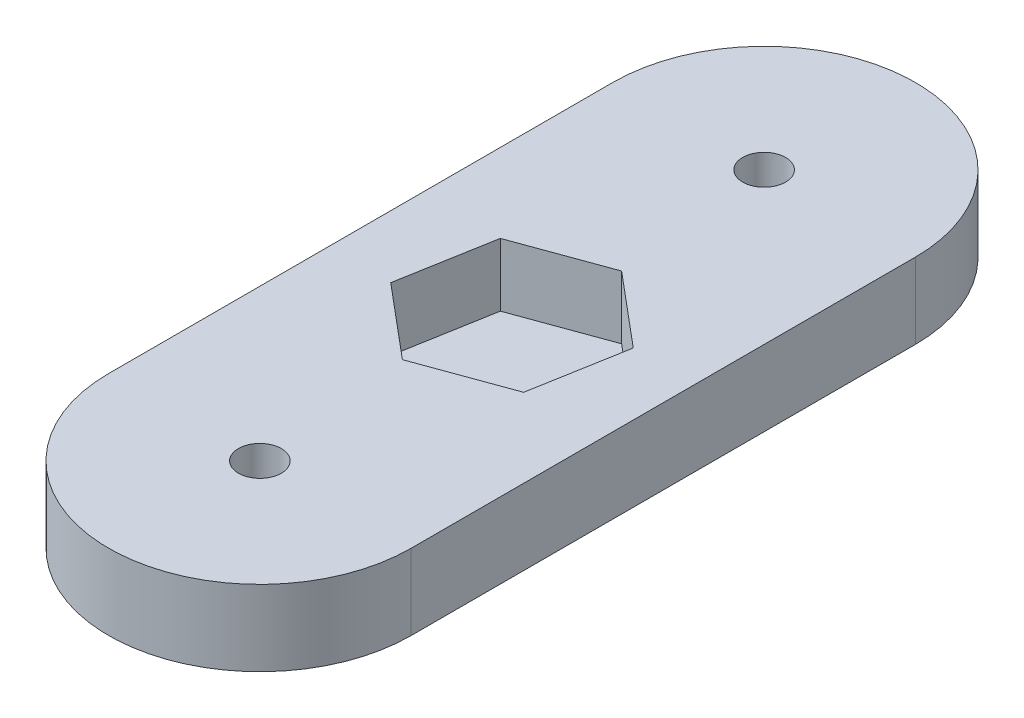
ISO-10303-21;
HEADER;
FILE_DESCRIPTION(('STEP AP214'),'2;1');
FILE_NAME('part.step','',(''),(''),'','','');
FILE_SCHEMA(('AUTOMOTIVE_DESIGN { 1 0 10303 214 1 1 1 1 }'));
ENDSEC;
DATA;
#1=APPLICATION_CONTEXT('core data for automotive mechanical design processes');
#2=APPLICATION_PROTOCOL_DEFINITION('international standard','automotive_design',2000,#1);
#3=PRODUCT_CONTEXT('',#1,'mechanical');
#4=PRODUCT('Part','Part','',(#3));
#5=PRODUCT_RELATED_PRODUCT_CATEGORY('part','',(#4));
#6=PRODUCT_DEFINITION_FORMATION('','',#4);
#7=PRODUCT_DEFINITION_CONTEXT('part definition',#1,'design');
#8=PRODUCT_DEFINITION('design','',#6,#7);
#9=PRODUCT_DEFINITION_SHAPE('','',#8);
#10=(LENGTH_UNIT() NAMED_UNIT(*) SI_UNIT(.MILLI.,.METRE.));
#11=(NAMED_UNIT(*) PLANE_ANGLE_UNIT() SI_UNIT($,.RADIAN.));
#12=(NAMED_UNIT(*) SI_UNIT($,.STERADIAN.) SOLID_ANGLE_UNIT());
#13=UNCERTAINTY_MEASURE_WITH_UNIT(LENGTH_MEASURE(1.E-05),#10,'distance_accuracy_value','');
#14=(GEOMETRIC_REPRESENTATION_CONTEXT(3) GLOBAL_UNCERTAINTY_ASSIGNED_CONTEXT((#13)) GLOBAL_UNIT_ASSIGNED_CONTEXT((#10,
#11,#12)) REPRESENTATION_CONTEXT('',''));
#15=CARTESIAN_POINT('',(0.,0.,0.));
#16=DIRECTION('',(0.,0.,1.));
#17=DIRECTION('',(1.,0.,0.));
#18=AXIS2_PLACEMENT_3D('',#15,#16,#17);
#19=CARTESIAN_POINT('',(0.,6.,0.));
#20=DIRECTION('',(0.,1.,0.));
#21=DIRECTION('',(0.,0.,1.));
#22=AXIS2_PLACEMENT_3D('',#19,#20,#21);
#23=PLANE('',#22);
#24=DIRECTION('',(0.939692620785907,0.,-0.342020143325673));
#25=VECTOR('',#24,1.);
#26=CARTESIAN_POINT('',(-1.30332568756374,6.,-12.6084727230788));
#27=LINE('',#26,#25);
#28=CARTESIAN_POINT('',(-1.30332568756374,6.,-12.6084727230788));
#29=VERTEX_POINT('',#28);
#30=CARTESIAN_POINT('',(5.74958755079748,6.,-15.1755232067044));
#31=VERTEX_POINT('',#30);
#32=EDGE_CURVE('E48',#29,#31,#27,.T.);
#33=ORIENTED_EDGE('',*,*,#32,.F.);
#34=DIRECTION('',(0.766044443118981,0.,0.642787609686536));
#35=VECTOR('',#34,1.);
#36=CARTESIAN_POINT('',(-7.05291323836123,6.,-17.4329495163744));
#37=LINE('',#36,#35);
#38=CARTESIAN_POINT('',(-7.05291323836123,6.,-17.4329495163744));
#39=VERTEX_POINT('',#38);
#40=EDGE_CURVE('E140',#39,#29,#37,.T.);
#41=ORIENTED_EDGE('',*,*,#40,.F.);
#42=DIRECTION('',(-0.173648177666927,0.,0.984807753012209));
#43=VECTOR('',#42,1.);
#44=CARTESIAN_POINT('',(-5.74958755079748,6.,-24.8244767932956));
#45=LINE('',#44,#43);
#46=CARTESIAN_POINT('',(-5.74958755079748,6.,-24.8244767932956));
#47=VERTEX_POINT('',#46);
#48=EDGE_CURVE('E143',#47,#39,#45,.T.);
#49=ORIENTED_EDGE('',*,*,#48,.F.);
#50=DIRECTION('',(-0.939692620785907,0.,0.342020143325673));
#51=VECTOR('',#50,1.);
#52=CARTESIAN_POINT('',(1.30332568756374,6.,-27.3915272769212));
#53=LINE('',#52,#51);
#54=CARTESIAN_POINT('',(1.30332568756374,6.,-27.3915272769212));
#55=VERTEX_POINT('',#54);
#56=EDGE_CURVE('E159',#55,#47,#53,.T.);
#57=ORIENTED_EDGE('',*,*,#56,.F.);
#58=DIRECTION('',(-0.766044443118981,0.,-0.642787609686536));
#59=VECTOR('',#58,1.);
#60=CARTESIAN_POINT('',(7.05291323836123,6.,-22.5670504836256));
#61=LINE('',#60,#59);
#62=CARTESIAN_POINT('',(7.05291323836123,6.,-22.5670504836256));
#63=VERTEX_POINT('',#62);
#64=EDGE_CURVE('E156',#63,#55,#61,.T.);
#65=ORIENTED_EDGE('',*,*,#64,.F.);
#66=DIRECTION('',(0.173648177666927,0.,-0.984807753012209));
#67=VECTOR('',#66,1.);
#68=CARTESIAN_POINT('',(5.74958755079749,6.,-15.1755232067044));
#69=LINE('',#68,#67);
#70=EDGE_CURVE('E154',#31,#63,#69,.T.);
#71=ORIENTED_EDGE('',*,*,#70,.F.);
#72=EDGE_LOOP('',(#33,#41,#49,#57,#65,#71));
#73=FACE_BOUND('',#72,.T.);
#74=CARTESIAN_POINT('',(0.,6.,-40.));
#75=DIRECTION('',(0.,1.,0.));
#76=DIRECTION('',(0.,0.,1.));
#77=AXIS2_PLACEMENT_3D('',#74,#75,#76);
#78=CIRCLE('',#77,1.7);
#79=CARTESIAN_POINT('',(0.,6.,-38.3));
#80=VERTEX_POINT('',#79);
#81=EDGE_CURVE('E180',#80,#80,#78,.T.);
#82=ORIENTED_EDGE('',*,*,#81,.F.);
#83=EDGE_LOOP('',(#82));
#84=FACE_BOUND('',#83,.T.);
#85=CARTESIAN_POINT('',(0.,6.,0.));
#86=DIRECTION('',(0.,1.,0.));
#87=DIRECTION('',(0.,0.,1.));
#88=AXIS2_PLACEMENT_3D('',#85,#86,#87);
#89=CIRCLE('',#88,12.);
#90=CARTESIAN_POINT('',(-12.,6.,0.));
#91=VERTEX_POINT('',#90);
#92=CARTESIAN_POINT('',(12.,6.,0.));
#93=VERTEX_POINT('',#92);
#94=EDGE_CURVE('E186',#91,#93,#89,.T.);
#95=ORIENTED_EDGE('',*,*,#94,.T.);
#96=DIRECTION('',(0.,0.,-1.));
#97=VECTOR('',#96,1.);
#98=CARTESIAN_POINT('',(12.,6.,0.));
#99=LINE('',#98,#97);
#100=CARTESIAN_POINT('',(12.,6.,-40.));
#101=VERTEX_POINT('',#100);
#102=EDGE_CURVE('E85',#93,#101,#99,.T.);
#103=ORIENTED_EDGE('',*,*,#102,.T.);
#104=CARTESIAN_POINT('',(0.,6.,-40.));
#105=DIRECTION('',(0.,1.,0.));
#106=DIRECTION('',(0.,0.,1.));
#107=AXIS2_PLACEMENT_3D('',#104,#105,#106);
#108=CIRCLE('',#107,12.);
#109=CARTESIAN_POINT('',(-12.,6.,-40.));
#110=VERTEX_POINT('',#109);
#111=EDGE_CURVE('E189',#101,#110,#108,.T.);
#112=ORIENTED_EDGE('',*,*,#111,.T.);
#113=DIRECTION('',(0.,0.,1.));
#114=VECTOR('',#113,1.);
#115=CARTESIAN_POINT('',(-12.,6.,0.));
#116=LINE('',#115,#114);
#117=EDGE_CURVE('E57',#110,#91,#116,.T.);
#118=ORIENTED_EDGE('',*,*,#117,.T.);
#119=EDGE_LOOP('',(#95,#103,#112,#118));
#120=FACE_BOUND('',#119,.T.);
#121=CARTESIAN_POINT('',(0.,6.,0.));
#122=DIRECTION('',(0.,1.,0.));
#123=DIRECTION('',(0.,0.,1.));
#124=AXIS2_PLACEMENT_3D('',#121,#122,#123);
#125=CIRCLE('',#124,1.7);
#126=CARTESIAN_POINT('',(0.,6.,1.7));
#127=VERTEX_POINT('',#126);
#128=EDGE_CURVE('E174',#127,#127,#125,.T.);
#129=ORIENTED_EDGE('',*,*,#128,.F.);
#130=EDGE_LOOP('',(#129));
#131=FACE_BOUND('',#130,.T.);
#132=ADVANCED_FACE('F33',(#73,#84,#120,#131),#23,.T.);
#133=CARTESIAN_POINT('',(0.,0.,0.));
#134=DIRECTION('',(0.,1.,0.));
#135=DIRECTION('',(0.,0.,1.));
#136=AXIS2_PLACEMENT_3D('',#133,#134,#135);
#137=PLANE('',#136);
#138=CARTESIAN_POINT('',(0.,0.,-40.));
#139=DIRECTION('',(0.,1.,0.));
#140=DIRECTION('',(0.,0.,1.));
#141=AXIS2_PLACEMENT_3D('',#138,#139,#140);
#142=CIRCLE('',#141,1.7);
#143=CARTESIAN_POINT('',(0.,0.,-38.3));
#144=VERTEX_POINT('',#143);
#145=EDGE_CURVE('E177',#144,#144,#142,.T.);
#146=ORIENTED_EDGE('',*,*,#145,.T.);
#147=EDGE_LOOP('',(#146));
#148=FACE_BOUND('',#147,.T.);
#149=CARTESIAN_POINT('',(0.,0.,0.));
#150=DIRECTION('',(0.,1.,0.));
#151=DIRECTION('',(0.,0.,1.));
#152=AXIS2_PLACEMENT_3D('',#149,#150,#151);
#153=CIRCLE('',#152,12.);
#154=CARTESIAN_POINT('',(-12.,0.,0.));
#155=VERTEX_POINT('',#154);
#156=CARTESIAN_POINT('',(12.,0.,0.));
#157=VERTEX_POINT('',#156);
#158=EDGE_CURVE('E183',#155,#157,#153,.T.);
#159=ORIENTED_EDGE('',*,*,#158,.F.);
#160=DIRECTION('',(0.,0.,1.));
#161=VECTOR('',#160,1.);
#162=CARTESIAN_POINT('',(-12.,0.,0.));
#163=LINE('',#162,#161);
#164=CARTESIAN_POINT('',(-12.,0.,-40.));
#165=VERTEX_POINT('',#164);
#166=EDGE_CURVE('E78',#165,#155,#163,.T.);
#167=ORIENTED_EDGE('',*,*,#166,.F.);
#168=CARTESIAN_POINT('',(0.,0.,-40.));
#169=DIRECTION('',(0.,1.,0.));
#170=DIRECTION('',(0.,0.,1.));
#171=AXIS2_PLACEMENT_3D('',#168,#169,#170);
#172=CIRCLE('',#171,12.);
#173=CARTESIAN_POINT('',(12.,0.,-40.));
#174=VERTEX_POINT('',#173);
#175=EDGE_CURVE('E197',#174,#165,#172,.T.);
#176=ORIENTED_EDGE('',*,*,#175,.F.);
#177=DIRECTION('',(0.,0.,-1.));
#178=VECTOR('',#177,1.);
#179=CARTESIAN_POINT('',(12.,0.,0.));
#180=LINE('',#179,#178);
#181=EDGE_CURVE('E195',#157,#174,#180,.T.);
#182=ORIENTED_EDGE('',*,*,#181,.F.);
#183=EDGE_LOOP('',(#159,#167,#176,#182));
#184=FACE_BOUND('',#183,.T.);
#185=CARTESIAN_POINT('',(0.,0.,0.));
#186=DIRECTION('',(0.,1.,0.));
#187=DIRECTION('',(0.,0.,1.));
#188=AXIS2_PLACEMENT_3D('',#185,#186,#187);
#189=CIRCLE('',#188,1.7);
#190=CARTESIAN_POINT('',(0.,0.,1.7));
#191=VERTEX_POINT('',#190);
#192=EDGE_CURVE('E166',#191,#191,#189,.T.);
#193=ORIENTED_EDGE('',*,*,#192,.T.);
#194=EDGE_LOOP('',(#193));
#195=FACE_BOUND('',#194,.T.);
#196=ADVANCED_FACE('F210',(#148,#184,#195),#137,.F.);
#197=CARTESIAN_POINT('',(0.,6.,0.));
#198=DIRECTION('',(0.,-1.,0.));
#199=DIRECTION('',(0.,0.,-1.));
#200=AXIS2_PLACEMENT_3D('',#197,#198,#199);
#201=CYLINDRICAL_SURFACE('',#200,12.);
#202=ORIENTED_EDGE('',*,*,#158,.T.);
#203=DIRECTION('',(0.,-1.,0.));
#204=VECTOR('',#203,1.);
#205=CARTESIAN_POINT('',(12.,6.,0.));
#206=LINE('',#205,#204);
#207=EDGE_CURVE('E11',#93,#157,#206,.T.);
#208=ORIENTED_EDGE('',*,*,#207,.F.);
#209=ORIENTED_EDGE('',*,*,#94,.F.);
#210=DIRECTION('',(0.,-1.,0.));
#211=VECTOR('',#210,1.);
#212=CARTESIAN_POINT('',(-12.,6.,0.));
#213=LINE('',#212,#211);
#214=EDGE_CURVE('E192',#91,#155,#213,.T.);
#215=ORIENTED_EDGE('',*,*,#214,.T.);
#216=EDGE_LOOP('',(#202,#208,#209,#215));
#217=FACE_BOUND('',#216,.T.);
#218=ADVANCED_FACE('F35',(#217),#201,.T.);
#219=CARTESIAN_POINT('',(12.,6.,0.));
#220=DIRECTION('',(-1.,0.,0.));
#221=DIRECTION('',(0.,0.,1.));
#222=AXIS2_PLACEMENT_3D('',#219,#220,#221);
#223=PLANE('',#222);
#224=ORIENTED_EDGE('',*,*,#181,.T.);
#225=DIRECTION('',(0.,-1.,0.));
#226=VECTOR('',#225,1.);
#227=CARTESIAN_POINT('',(12.,6.,-40.));
#228=LINE('',#227,#226);
#229=EDGE_CURVE('E41',#101,#174,#228,.T.);
#230=ORIENTED_EDGE('',*,*,#229,.F.);
#231=ORIENTED_EDGE('',*,*,#102,.F.);
#232=ORIENTED_EDGE('',*,*,#207,.T.);
#233=EDGE_LOOP('',(#224,#230,#231,#232));
#234=FACE_BOUND('',#233,.T.);
#235=ADVANCED_FACE('F226',(#234),#223,.F.);
#236=CARTESIAN_POINT('',(0.,6.,-40.));
#237=DIRECTION('',(0.,-1.,0.));
#238=DIRECTION('',(0.,0.,-1.));
#239=AXIS2_PLACEMENT_3D('',#236,#237,#238);
#240=CYLINDRICAL_SURFACE('',#239,12.);
#241=ORIENTED_EDGE('',*,*,#175,.T.);
#242=DIRECTION('',(0.,-1.,0.));
#243=VECTOR('',#242,1.);
#244=CARTESIAN_POINT('',(-12.,6.,-40.));
#245=LINE('',#244,#243);
#246=EDGE_CURVE('E201',#110,#165,#245,.T.);
#247=ORIENTED_EDGE('',*,*,#246,.F.);
#248=ORIENTED_EDGE('',*,*,#111,.F.);
#249=ORIENTED_EDGE('',*,*,#229,.T.);
#250=EDGE_LOOP('',(#241,#247,#248,#249));
#251=FACE_BOUND('',#250,.T.);
#252=ADVANCED_FACE('F206',(#251),#240,.T.);
#253=CARTESIAN_POINT('',(-12.,6.,0.));
#254=DIRECTION('',(1.,0.,0.));
#255=DIRECTION('',(0.,0.,-1.));
#256=AXIS2_PLACEMENT_3D('',#253,#254,#255);
#257=PLANE('',#256);
#258=ORIENTED_EDGE('',*,*,#166,.T.);
#259=ORIENTED_EDGE('',*,*,#214,.F.);
#260=ORIENTED_EDGE('',*,*,#117,.F.);
#261=ORIENTED_EDGE('',*,*,#246,.T.);
#262=EDGE_LOOP('',(#258,#259,#260,#261));
#263=FACE_BOUND('',#262,.T.);
#264=ADVANCED_FACE('F215',(#263),#257,.F.);
#265=CARTESIAN_POINT('',(0.,6.,-40.));
#266=DIRECTION('',(0.,-1.,0.));
#267=DIRECTION('',(0.,0.,-1.));
#268=AXIS2_PLACEMENT_3D('',#265,#266,#267);
#269=CYLINDRICAL_SURFACE('',#268,1.7);
#270=ORIENTED_EDGE('',*,*,#81,.T.);
#271=EDGE_LOOP('',(#270));
#272=FACE_BOUND('',#271,.T.);
#273=ORIENTED_EDGE('',*,*,#145,.F.);
#274=EDGE_LOOP('',(#273));
#275=FACE_BOUND('',#274,.T.);
#276=ADVANCED_FACE('F217',(#272,#275),#269,.F.);
#277=CARTESIAN_POINT('',(0.,6.,0.));
#278=DIRECTION('',(0.,-1.,0.));
#279=DIRECTION('',(0.,0.,-1.));
#280=AXIS2_PLACEMENT_3D('',#277,#278,#279);
#281=CYLINDRICAL_SURFACE('',#280,1.7);
#282=ORIENTED_EDGE('',*,*,#128,.T.);
#283=EDGE_LOOP('',(#282));
#284=FACE_BOUND('',#283,.T.);
#285=ORIENTED_EDGE('',*,*,#192,.F.);
#286=EDGE_LOOP('',(#285));
#287=FACE_BOUND('',#286,.T.);
#288=ADVANCED_FACE('F223',(#284,#287),#281,.F.);
#289=CARTESIAN_POINT('',(-1.30332568756374,1.,-12.6084727230788));
#290=DIRECTION('',(0.342020143325673,0.,0.939692620785907));
#291=DIRECTION('',(0.939692620785907,0.,-0.342020143325673));
#292=AXIS2_PLACEMENT_3D('',#289,#290,#291);
#293=PLANE('',#292);
#294=ORIENTED_EDGE('',*,*,#32,.T.);
#295=DIRECTION('',(0.,1.,0.));
#296=VECTOR('',#295,1.);
#297=CARTESIAN_POINT('',(5.74958755079749,1.,-15.1755232067044));
#298=LINE('',#297,#296);
#299=CARTESIAN_POINT('',(5.74958755079749,1.,-15.1755232067044));
#300=VERTEX_POINT('',#299);
#301=EDGE_CURVE('E117',#300,#31,#298,.T.);
#302=ORIENTED_EDGE('',*,*,#301,.F.);
#303=DIRECTION('',(0.939692620785907,0.,-0.342020143325673));
#304=VECTOR('',#303,1.);
#305=CARTESIAN_POINT('',(-1.30332568756374,1.,-12.6084727230788));
#306=LINE('',#305,#304);
#307=CARTESIAN_POINT('',(-1.30332568756374,1.,-12.6084727230788));
#308=VERTEX_POINT('',#307);
#309=EDGE_CURVE('E121',#308,#300,#306,.T.);
#310=ORIENTED_EDGE('',*,*,#309,.F.);
#311=DIRECTION('',(0.,1.,0.));
#312=VECTOR('',#311,1.);
#313=CARTESIAN_POINT('',(-1.30332568756374,1.,-12.6084727230788));
#314=LINE('',#313,#312);
#315=EDGE_CURVE('E164',#308,#29,#314,.T.);
#316=ORIENTED_EDGE('',*,*,#315,.T.);
#317=EDGE_LOOP('',(#294,#302,#310,#316));
#318=FACE_BOUND('',#317,.T.);
#319=ADVANCED_FACE('F119',(#318),#293,.F.);
#320=CARTESIAN_POINT('',(-7.05291323836123,1.,-17.4329495163744));
#321=DIRECTION('',(-0.642787609686536,0.,0.766044443118981));
#322=DIRECTION('',(0.766044443118981,0.,0.642787609686536));
#323=AXIS2_PLACEMENT_3D('',#320,#321,#322);
#324=PLANE('',#323);
#325=ORIENTED_EDGE('',*,*,#40,.T.);
#326=ORIENTED_EDGE('',*,*,#315,.F.);
#327=DIRECTION('',(0.766044443118981,0.,0.642787609686536));
#328=VECTOR('',#327,1.);
#329=CARTESIAN_POINT('',(-7.05291323836123,1.,-17.4329495163744));
#330=LINE('',#329,#328);
#331=CARTESIAN_POINT('',(-7.05291323836123,1.,-17.4329495163744));
#332=VERTEX_POINT('',#331);
#333=EDGE_CURVE('E127',#332,#308,#330,.T.);
#334=ORIENTED_EDGE('',*,*,#333,.F.);
#335=DIRECTION('',(0.,1.,0.));
#336=VECTOR('',#335,1.);
#337=CARTESIAN_POINT('',(-7.05291323836123,1.,-17.4329495163744));
#338=LINE('',#337,#336);
#339=EDGE_CURVE('E167',#332,#39,#338,.T.);
#340=ORIENTED_EDGE('',*,*,#339,.T.);
#341=EDGE_LOOP('',(#325,#326,#334,#340));
#342=FACE_BOUND('',#341,.T.);
#343=ADVANCED_FACE('F243',(#342),#324,.F.);
#344=CARTESIAN_POINT('',(-5.74958755079748,1.,-24.8244767932956));
#345=DIRECTION('',(-0.984807753012209,0.,-0.173648177666927));
#346=DIRECTION('',(-0.173648177666927,0.,0.984807753012209));
#347=AXIS2_PLACEMENT_3D('',#344,#345,#346);
#348=PLANE('',#347);
#349=ORIENTED_EDGE('',*,*,#48,.T.);
#350=ORIENTED_EDGE('',*,*,#339,.F.);
#351=DIRECTION('',(-0.173648177666927,0.,0.984807753012209));
#352=VECTOR('',#351,1.);
#353=CARTESIAN_POINT('',(-5.74958755079748,1.,-24.8244767932956));
#354=LINE('',#353,#352);
#355=CARTESIAN_POINT('',(-5.74958755079748,1.,-24.8244767932956));
#356=VERTEX_POINT('',#355);
#357=EDGE_CURVE('E150',#356,#332,#354,.T.);
#358=ORIENTED_EDGE('',*,*,#357,.F.);
#359=DIRECTION('',(0.,1.,0.));
#360=VECTOR('',#359,1.);
#361=CARTESIAN_POINT('',(-5.74958755079748,1.,-24.8244767932956));
#362=LINE('',#361,#360);
#363=EDGE_CURVE('E169',#356,#47,#362,.T.);
#364=ORIENTED_EDGE('',*,*,#363,.T.);
#365=EDGE_LOOP('',(#349,#350,#358,#364));
#366=FACE_BOUND('',#365,.T.);
#367=ADVANCED_FACE('F253',(#366),#348,.F.);
#368=CARTESIAN_POINT('',(1.30332568756374,1.,-27.3915272769212));
#369=DIRECTION('',(-0.342020143325673,0.,-0.939692620785907));
#370=DIRECTION('',(-0.939692620785907,0.,0.342020143325673));
#371=AXIS2_PLACEMENT_3D('',#368,#369,#370);
#372=PLANE('',#371);
#373=ORIENTED_EDGE('',*,*,#56,.T.);
#374=ORIENTED_EDGE('',*,*,#363,.F.);
#375=DIRECTION('',(-0.939692620785907,0.,0.342020143325673));
#376=VECTOR('',#375,1.);
#377=CARTESIAN_POINT('',(1.30332568756374,1.,-27.3915272769212));
#378=LINE('',#377,#376);
#379=CARTESIAN_POINT('',(1.30332568756374,1.,-27.3915272769212));
#380=VERTEX_POINT('',#379);
#381=EDGE_CURVE('E147',#380,#356,#378,.T.);
#382=ORIENTED_EDGE('',*,*,#381,.F.);
#383=DIRECTION('',(0.,1.,0.));
#384=VECTOR('',#383,1.);
#385=CARTESIAN_POINT('',(1.30332568756374,1.,-27.3915272769212));
#386=LINE('',#385,#384);
#387=EDGE_CURVE('E171',#380,#55,#386,.T.);
#388=ORIENTED_EDGE('',*,*,#387,.T.);
#389=EDGE_LOOP('',(#373,#374,#382,#388));
#390=FACE_BOUND('',#389,.T.);
#391=ADVANCED_FACE('F249',(#390),#372,.F.);
#392=CARTESIAN_POINT('',(7.05291323836123,1.,-22.5670504836256));
#393=DIRECTION('',(0.642787609686536,0.,-0.766044443118981));
#394=DIRECTION('',(-0.766044443118981,0.,-0.642787609686536));
#395=AXIS2_PLACEMENT_3D('',#392,#393,#394);
#396=PLANE('',#395);
#397=ORIENTED_EDGE('',*,*,#64,.T.);
#398=ORIENTED_EDGE('',*,*,#387,.F.);
#399=DIRECTION('',(-0.766044443118981,0.,-0.642787609686536));
#400=VECTOR('',#399,1.);
#401=CARTESIAN_POINT('',(7.05291323836123,1.,-22.5670504836256));
#402=LINE('',#401,#400);
#403=CARTESIAN_POINT('',(7.05291323836123,1.,-22.5670504836256));
#404=VERTEX_POINT('',#403);
#405=EDGE_CURVE('E135',#404,#380,#402,.T.);
#406=ORIENTED_EDGE('',*,*,#405,.F.);
#407=DIRECTION('',(0.,1.,0.));
#408=VECTOR('',#407,1.);
#409=CARTESIAN_POINT('',(7.05291323836123,1.,-22.5670504836256));
#410=LINE('',#409,#408);
#411=EDGE_CURVE('E126',#404,#63,#410,.T.);
#412=ORIENTED_EDGE('',*,*,#411,.T.);
#413=EDGE_LOOP('',(#397,#398,#406,#412));
#414=FACE_BOUND('',#413,.T.);
#415=ADVANCED_FACE('F246',(#414),#396,.F.);
#416=CARTESIAN_POINT('',(5.74958755079749,1.,-15.1755232067044));
#417=DIRECTION('',(0.984807753012209,0.,0.173648177666927));
#418=DIRECTION('',(0.173648177666927,0.,-0.984807753012209));
#419=AXIS2_PLACEMENT_3D('',#416,#417,#418);
#420=PLANE('',#419);
#421=ORIENTED_EDGE('',*,*,#70,.T.);
#422=ORIENTED_EDGE('',*,*,#411,.F.);
#423=DIRECTION('',(0.173648177666927,0.,-0.984807753012209));
#424=VECTOR('',#423,1.);
#425=CARTESIAN_POINT('',(5.74958755079749,1.,-15.1755232067044));
#426=LINE('',#425,#424);
#427=EDGE_CURVE('E130',#300,#404,#426,.T.);
#428=ORIENTED_EDGE('',*,*,#427,.F.);
#429=ORIENTED_EDGE('',*,*,#301,.T.);
#430=EDGE_LOOP('',(#421,#422,#428,#429));
#431=FACE_BOUND('',#430,.T.);
#432=ADVANCED_FACE('F131',(#431),#420,.F.);
#433=CARTESIAN_POINT('',(0.,1.,0.));
#434=DIRECTION('',(0.,1.,0.));
#435=DIRECTION('',(0.,0.,1.));
#436=AXIS2_PLACEMENT_3D('',#433,#434,#435);
#437=PLANE('',#436);
#438=ORIENTED_EDGE('',*,*,#309,.T.);
#439=ORIENTED_EDGE('',*,*,#427,.T.);
#440=ORIENTED_EDGE('',*,*,#405,.T.);
#441=ORIENTED_EDGE('',*,*,#381,.T.);
#442=ORIENTED_EDGE('',*,*,#357,.T.);
#443=ORIENTED_EDGE('',*,*,#333,.T.);
#444=EDGE_LOOP('',(#438,#439,#440,#441,#442,#443));
#445=FACE_BOUND('',#444,.T.);
#446=ADVANCED_FACE('F137',(#445),#437,.T.);
#447=CLOSED_SHELL('',(#132,#196,#218,#235,#252,#264,#276,#288,#319,#343,#367,#391,#415,#432,#446));
#448=MANIFOLD_SOLID_BREP('B2',#447);
#449=ADVANCED_BREP_SHAPE_REPRESENTATION('',(#18,#448),#14);
#450=SHAPE_DEFINITION_REPRESENTATION(#9,#449);
ENDSEC;
END-ISO-10303-21;
